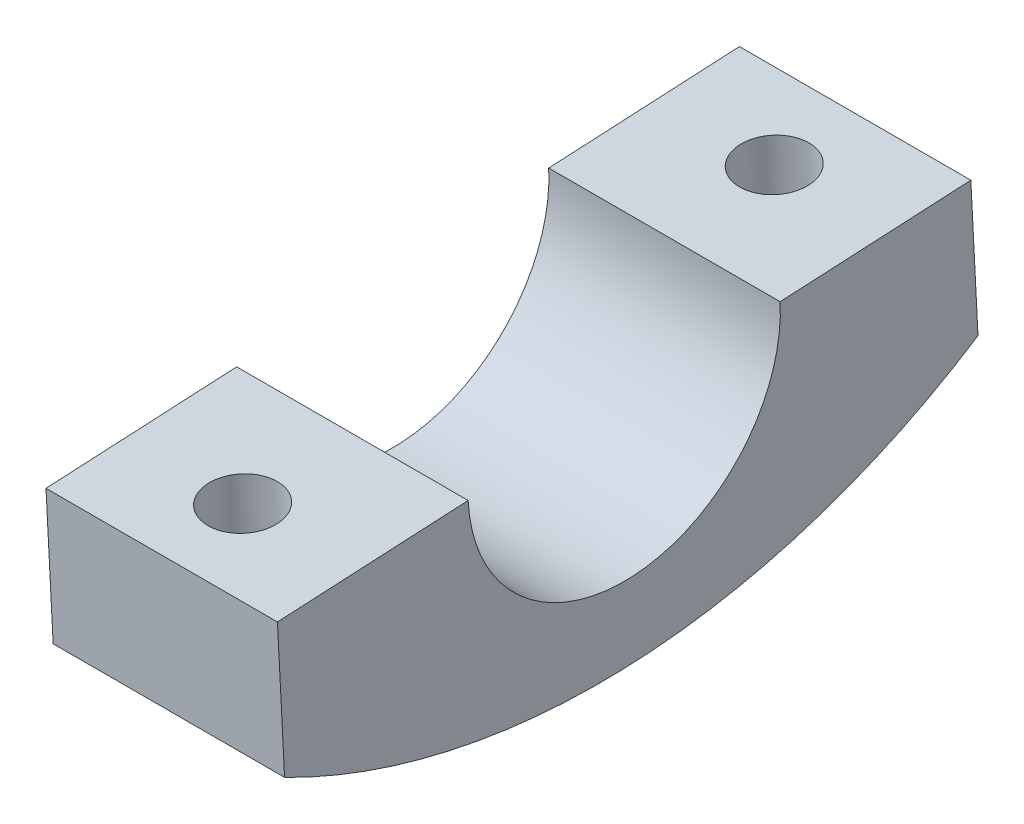
ISO-10303-21;
HEADER;
FILE_DESCRIPTION(('STEP AP214'),'2;1');
FILE_NAME('part.step','',(''),(''),'','','');
FILE_SCHEMA(('AUTOMOTIVE_DESIGN { 1 0 10303 214 1 1 1 1 }'));
ENDSEC;
DATA;
#1=APPLICATION_CONTEXT('core data for automotive mechanical design processes');
#2=APPLICATION_PROTOCOL_DEFINITION('international standard','automotive_design',2000,#1);
#3=PRODUCT_CONTEXT('',#1,'mechanical');
#4=PRODUCT('Part','Part','',(#3));
#5=PRODUCT_RELATED_PRODUCT_CATEGORY('part','',(#4));
#6=PRODUCT_DEFINITION_FORMATION('','',#4);
#7=PRODUCT_DEFINITION_CONTEXT('part definition',#1,'design');
#8=PRODUCT_DEFINITION('design','',#6,#7);
#9=PRODUCT_DEFINITION_SHAPE('','',#8);
#10=(LENGTH_UNIT() NAMED_UNIT(*) SI_UNIT(.MILLI.,.METRE.));
#11=(NAMED_UNIT(*) PLANE_ANGLE_UNIT() SI_UNIT($,.RADIAN.));
#12=(NAMED_UNIT(*) SI_UNIT($,.STERADIAN.) SOLID_ANGLE_UNIT());
#13=UNCERTAINTY_MEASURE_WITH_UNIT(LENGTH_MEASURE(1.E-05),#10,'distance_accuracy_value','');
#14=(GEOMETRIC_REPRESENTATION_CONTEXT(3) GLOBAL_UNCERTAINTY_ASSIGNED_CONTEXT((#13)) GLOBAL_UNIT_ASSIGNED_CONTEXT((#10,
#11,#12)) REPRESENTATION_CONTEXT('',''));
#15=CARTESIAN_POINT('',(0.,0.,0.));
#16=DIRECTION('',(0.,0.,1.));
#17=DIRECTION('',(1.,0.,0.));
#18=AXIS2_PLACEMENT_3D('',#15,#16,#17);
#19=CARTESIAN_POINT('',(20.,219.261332748783,3990.61911649571));
#20=DIRECTION('',(-1.,0.,0.));
#21=DIRECTION('',(0.,0.,1.));
#22=AXIS2_PLACEMENT_3D('',#19,#20,#21);
#23=CYLINDRICAL_SURFACE('',#22,59.9999999999999);
#24=CARTESIAN_POINT('',(12.6925824035531,168.918830501828,3957.97508997453));
#25=CARTESIAN_POINT('',(12.8918575892867,168.870693933646,3958.04932884496));
#26=CARTESIAN_POINT('',(13.0869006497999,168.8176326054,3958.13151306236));
#27=CARTESIAN_POINT('',(13.4672297740175,168.702748389836,3958.31058944848));
#28=CARTESIAN_POINT('',(13.652523448015,168.640932479727,3958.40746990894));
#29=CARTESIAN_POINT('',(14.011526599575,168.509859226538,3958.61438507205));
#30=CARTESIAN_POINT('',(14.1852868816071,168.440638592483,3958.72435516315));
#31=CARTESIAN_POINT('',(14.5213657738825,168.295539397078,3958.95673062363));
#32=CARTESIAN_POINT('',(14.6836821731344,168.219659555473,3959.07913838491));
#33=CARTESIAN_POINT('',(14.9956373292621,168.062508283365,3959.33489036263));
#34=CARTESIAN_POINT('',(15.1453158910343,167.981255337644,3959.46819742243));
#35=CARTESIAN_POINT('',(15.4320589213895,167.814069317554,3959.74509346105));
#36=CARTESIAN_POINT('',(15.5691188587406,167.728134579492,3959.88868610066));
#37=CARTESIAN_POINT('',(15.9608530995083,167.464503534855,3960.33368923386));
#38=CARTESIAN_POINT('',(16.195941430184,167.281052275497,3960.64920886163));
#39=CARTESIAN_POINT('',(16.6303450674783,166.88738765179,3961.34210970982));
#40=CARTESIAN_POINT('',(16.8240415403241,166.676297707441,3961.72252208433));
#41=CARTESIAN_POINT('',(17.0616753380039,166.357595925663,3962.31284320151));
#42=CARTESIAN_POINT('',(17.1320917652659,166.250959528602,3962.51301379589));
#43=CARTESIAN_POINT('',(17.2548960072896,166.037777722091,3962.91883524779));
#44=CARTESIAN_POINT('',(17.3072895388382,165.931232294502,3963.12448434521));
#45=CARTESIAN_POINT('',(17.3962038825714,165.712747006982,3963.55234626329));
#46=CARTESIAN_POINT('',(17.4316032175293,165.600860609197,3963.77481956673));
#47=CARTESIAN_POINT('',(17.4812843844083,165.37900349324,3964.22296011985));
#48=CARTESIAN_POINT('',(17.4955740153601,165.269032082418,3964.44862615886));
#49=CARTESIAN_POINT('',(17.5026709930364,165.051756612034,3964.90170982088));
#50=CARTESIAN_POINT('',(17.4954686170726,164.944453781841,3965.12912819021));
#51=CARTESIAN_POINT('',(17.459260690759,164.733411445397,3965.58377002616));
#52=CARTESIAN_POINT('',(17.430265095486,164.629670334783,3965.81099353435));
#53=CARTESIAN_POINT('',(17.3512080761771,164.428771649236,3966.25830818574));
#54=CARTESIAN_POINT('',(17.301643015946,164.331517816753,3966.47844368379));
#55=CARTESIAN_POINT('',(17.1815180832235,164.14176561256,3966.91489923137));
#56=CARTESIAN_POINT('',(17.1109673734945,164.049265186045,3967.13122090253));
#57=CARTESIAN_POINT('',(16.9490152839946,163.869576947403,3967.55817475308));
#58=CARTESIAN_POINT('',(16.8576160093719,163.782388600024,3967.7688075045));
#59=CARTESIAN_POINT('',(16.6543161422313,163.613848423299,3968.18237552162));
#60=CARTESIAN_POINT('',(16.5424169355575,163.532496199934,3968.38531130653));
#61=CARTESIAN_POINT('',(16.306801865344,163.381282336956,3968.76826961665));
#62=CARTESIAN_POINT('',(16.1843630546434,163.311016425395,3968.94891898739));
#63=CARTESIAN_POINT('',(15.9228131484103,163.176293385962,3969.3000237532));
#64=CARTESIAN_POINT('',(15.7837032011436,163.111835858559,3969.47047984916));
#65=CARTESIAN_POINT('',(15.4897249967572,162.989007253703,3969.79950500223));
#66=CARTESIAN_POINT('',(15.3348610324396,162.930634526936,3969.9580772772));
#67=CARTESIAN_POINT('',(15.0104213501098,162.820164986589,3970.26179101645));
#68=CARTESIAN_POINT('',(14.8408462947235,162.76806789059,3970.40693308504));
#69=CARTESIAN_POINT('',(14.4990245640607,162.673290679058,3970.67388338625));
#70=CARTESIAN_POINT('',(14.3275724725477,162.630229899009,3970.79657505991));
#71=CARTESIAN_POINT('',(13.9740173315233,162.549871008494,3971.02766229346));
#72=CARTESIAN_POINT('',(13.7919147941147,162.512572621269,3971.13605853989));
#73=CARTESIAN_POINT('',(13.4184072504306,162.44380540272,3971.3375210949));
#74=CARTESIAN_POINT('',(13.22700379828,162.412335601676,3971.43058995325));
#75=CARTESIAN_POINT('',(12.8362959776022,162.35525578939,3971.60053486409));
#76=CARTESIAN_POINT('',(12.6369917474128,162.329645675601,3971.67741119995));
#77=CARTESIAN_POINT('',(12.2392803518228,162.285119413633,3971.811779007));
#78=CARTESIAN_POINT('',(12.0410977362077,162.265995998797,3971.8698672012));
#79=CARTESIAN_POINT('',(11.6402361332911,162.233221785474,3971.96979133098));
#80=CARTESIAN_POINT('',(11.4375572690062,162.219570837454,3972.01162771062));
#81=CARTESIAN_POINT('',(11.0291943387053,162.197744100676,3972.07867163647));
#82=CARTESIAN_POINT('',(10.8235105241181,162.189567856491,3972.10388056586));
#83=CARTESIAN_POINT('',(10.4106281276833,162.178688424372,3972.13744909046));
#84=CARTESIAN_POINT('',(10.2034295514045,162.175985216327,3972.14580874758));
#85=CARTESIAN_POINT('',(9.79212921496034,162.176050950103,3972.14560573137));
#86=CARTESIAN_POINT('',(9.58802726905062,162.178739033027,3972.13729310982));
#87=CARTESIAN_POINT('',(9.18121851573012,162.189428191364,3972.10431133245));
#88=CARTESIAN_POINT('',(8.97851220875276,162.19743108151,3972.07963658981));
#89=CARTESIAN_POINT('',(8.57605457189065,162.218749515713,3972.01414723362));
#90=CARTESIAN_POINT('',(8.37630259337743,162.232063875116,3971.97333621906));
#91=CARTESIAN_POINT('',(7.98111554751912,162.264003734349,3971.87592815759));
#92=CARTESIAN_POINT('',(7.78568057104067,162.282629345859,3971.81933077874));
#93=CARTESIAN_POINT('',(7.40060690080018,162.325172724418,3971.69087694832));
#94=CARTESIAN_POINT('',(7.21096506130666,162.349087559063,3971.61902895275));
#95=CARTESIAN_POINT('',(6.83866811400861,162.402199408377,3971.46067383432));
#96=CARTESIAN_POINT('',(6.65601313794026,162.431396522584,3971.37416643523));
#97=CARTESIAN_POINT('',(6.29895956636046,162.495036500121,3971.18725221226));
#98=CARTESIAN_POINT('',(6.12455947373713,162.529478407435,3971.08684792178));
#99=CARTESIAN_POINT('',(5.78506679510095,162.603575339016,3970.87294382088));
#100=CARTESIAN_POINT('',(5.61997748320467,162.643232180972,3970.75943944607));
#101=CARTESIAN_POINT('',(5.29822628962452,162.728202965281,3970.51882517304));
#102=CARTESIAN_POINT('',(5.14169492133268,162.773581192604,3970.39156347726));
#103=CARTESIAN_POINT('',(4.84022948545276,162.869509326859,3970.12564849597));
#104=CARTESIAN_POINT('',(4.69529967479175,162.920061116751,3969.98699106653));
#105=CARTESIAN_POINT('',(4.41796595495633,163.026176785746,3969.69949165973));
#106=CARTESIAN_POINT('',(4.28556026630324,163.081739950615,3969.55065113442));
#107=CARTESIAN_POINT('',(4.03396016481127,163.197712712304,3969.24395839529));
#108=CARTESIAN_POINT('',(3.91476648903119,163.258122579185,3969.08610567946));
#109=CARTESIAN_POINT('',(3.68670559863705,163.385516341266,3968.75761797722));
#110=CARTESIAN_POINT('',(3.57827153166037,163.45264573455,3968.58673869481));
#111=CARTESIAN_POINT('',(3.376559660398,163.591558098273,3968.23806631742));
#112=CARTESIAN_POINT('',(3.28328246110761,163.663341254309,3968.06027294681));
#113=CARTESIAN_POINT('',(3.11223888301205,163.811244846049,3967.69912912037));
#114=CARTESIAN_POINT('',(3.0344721468693,163.887365181779,3967.51577879268));
#115=CARTESIAN_POINT('',(2.89464003375428,164.043619657252,3967.14477532647));
#116=CARTESIAN_POINT('',(2.83258022932898,164.123755209479,3966.95712068654));
#117=CARTESIAN_POINT('',(2.72145087843736,164.29193925348,3966.56890165213));
#118=CARTESIAN_POINT('',(2.67323506071429,164.380182283189,3966.36817695844));
#119=CARTESIAN_POINT('',(2.59432808868308,164.560204060446,3965.9647997158));
#120=CARTESIAN_POINT('',(2.56364352204922,164.651984123285,3965.76214647121));
#121=CARTESIAN_POINT('',(2.51972012646667,164.838526322891,3965.35633826807));
#122=CARTESIAN_POINT('',(2.50647969096449,164.933288184219,3965.15318335744));
#123=CARTESIAN_POINT('',(2.49723524814939,165.125249435114,3964.74760751109));
#124=CARTESIAN_POINT('',(2.50123742502912,165.222449686798,3964.54518686478));
#125=CARTESIAN_POINT('',(2.54042962309447,165.529755188305,3963.91434753183));
#126=CARTESIAN_POINT('',(2.60576010164722,165.743286730545,3963.48911163753));
#127=CARTESIAN_POINT('',(2.81084263777274,166.172687352789,3962.65816614472));
#128=CARTESIAN_POINT('',(2.95061407827022,166.388557027248,3962.25246166182));
#129=CARTESIAN_POINT('',(3.21745010771056,166.71384926745,3961.65678118965));
#130=CARTESIAN_POINT('',(3.31892937155765,166.825058623929,3961.45599167551));
#131=CARTESIAN_POINT('',(3.54080991132869,167.045098642271,3961.06382409455));
#132=CARTESIAN_POINT('',(3.66120409353774,167.153930178536,3960.87244253462));
#133=CARTESIAN_POINT('',(3.92055057982027,167.368200958184,3960.50020056697));
#134=CARTESIAN_POINT('',(4.05952790084516,167.473635386636,3960.31935482235));
#135=CARTESIAN_POINT('',(4.35524374923841,167.67964015668,3959.96997152995));
#136=CARTESIAN_POINT('',(4.51197359222992,167.78021284253,3959.8014280298));
#137=CARTESIAN_POINT('',(4.83927561865108,167.973245545321,3959.48125570749));
#138=CARTESIAN_POINT('',(5.00951403467004,168.065826401986,3959.32935894896));
#139=CARTESIAN_POINT('',(5.36565969788903,168.243671873931,3959.04021375354));
#140=CARTESIAN_POINT('',(5.55157051412906,168.328934813749,3958.90296866947));
#141=CARTESIAN_POINT('',(5.93728218903124,168.490354896823,3958.64520737646));
#142=CARTESIAN_POINT('',(6.13703145505451,168.566543257622,3958.52463357174));
#143=CARTESIAN_POINT('',(6.54956991947036,168.708614653927,3958.30131637036));
#144=CARTESIAN_POINT('',(6.76234595906862,168.774507857455,3958.19855536975));
#145=CARTESIAN_POINT('',(7.03452723470459,168.84929752171,3958.08256095836));
#146=CARTESIAN_POINT('',(7.08866394712375,168.863722470343,3958.06022295745));
#147=CARTESIAN_POINT('',(7.19756546695407,168.891832443374,3958.01675295132));
#148=CARTESIAN_POINT('',(7.2523298345465,168.905517951584,3957.99562015702));
#149=CARTESIAN_POINT('',(7.3074175964468,168.918830501828,3957.97508997453));
#150=B_SPLINE_CURVE_WITH_KNOTS('',3,(#24,#25,#26,#27,#28,#29,#30,#31,#32,#33,#34,#35,#36,#37,
#38,#39,#40,#41,#42,#43,#44,#45,#46,#47,#48,#49,#50,#51,#52,#53,#54,#55,#56,#57,#58,#59,#60,#61,
#62,#63,#64,#65,#66,#67,#68,#69,#70,#71,#72,#73,#74,#75,#76,#77,#78,#79,#80,#81,#82,#83,#84,#85,
#86,#87,#88,#89,#90,#91,#92,#93,#94,#95,#96,#97,#98,#99,#100,#101,#102,#103,#104,#105,#106,#107,
#108,#109,#110,#111,#112,#113,#114,#115,#116,#117,#118,#119,#120,#121,#122,#123,#124,#125,#126,
#127,#128,#129,#130,#131,#132,#133,#134,#135,#136,#137,#138,#139,#140,#141,#142,#143,#144,#145,
#146,#147,#148,#149),.UNSPECIFIED.,.F.,.F.,(4,2,2,2,2,2,2,2,2,2,2,2,2,2,2,2,2,2,2,2,2,2,2,2,2,2,
2,2,2,2,2,2,2,2,2,2,2,2,2,2,2,2,2,2,2,2,2,2,2,2,2,2,2,2,2,2,2,2,2,2,2,2,4),(0.,
0.653755744365878,1.30699336162574,1.95713074483776,2.60739339421188,3.2555249462002,
3.90388833583695,5.20119630716475,6.62333505999947,7.33517164203455,8.04678222384112,
8.80046185364646,9.55386296501464,10.3076049563536,11.0610028497287,11.797189963166,
12.5330561129446,13.2688479927653,14.0045901496512,14.691504743799,15.3783720521675,
16.0650526953094,16.7517024246015,17.3964481180394,18.0411628357729,18.6857701936612,
19.3303662698507,19.9518266758719,20.5732700997689,21.1946618210278,21.8160512590054,
22.4281907530646,23.0405393688695,23.6527514845977,24.2649764742486,24.8768628867024,
25.4887608304933,26.1005473714354,26.7125477213919,27.3321676040689,27.9520138098127,
28.5717718125516,29.1915643723588,29.8305173728566,30.4694958712782,31.1084596469015,
31.7476497990153,32.4204199715272,33.0934427832117,33.7664036071281,34.4396058135959,
35.8737871717582,37.3083421445121,38.0604670716909,38.812310597734,39.5651766551701,
40.3176759949746,41.0553417751285,41.7931759983903,42.528393818596,43.2628808464005,
43.4438124039154,43.6246241085267),.UNSPECIFIED.);
#151=CARTESIAN_POINT('',(12.6925824035531,168.918830501835,3957.97508997453));
#152=VERTEX_POINT('',#151);
#153=CARTESIAN_POINT('',(7.30741759644689,168.918830501828,3957.97508997453));
#154=VERTEX_POINT('',#153);
#155=EDGE_CURVE('E127',#152,#154,#150,.T.);
#156=ORIENTED_EDGE('',*,*,#155,.F.);
#157=DIRECTION('',(-1.,0.,0.));
#158=VECTOR('',#157,1.);
#159=CARTESIAN_POINT('',(20.,168.918830501828,3957.97508997453));
#160=LINE('',#159,#158);
#161=CARTESIAN_POINT('',(20.,168.918830501828,3957.97508997453));
#162=VERTEX_POINT('',#161);
#163=EDGE_CURVE('E12',#162,#152,#160,.T.);
#164=ORIENTED_EDGE('',*,*,#163,.F.);
#165=CARTESIAN_POINT('',(20.,219.261332748783,3990.61911649571));
#166=DIRECTION('',(1.,0.,0.));
#167=DIRECTION('',(0.,0.,-1.));
#168=AXIS2_PLACEMENT_3D('',#165,#166,#167);
#169=CIRCLE('',#168,59.9999999999999);
#170=CARTESIAN_POINT('',(20.,165.819525376152,4017.89498907106));
#171=VERTEX_POINT('',#170);
#172=EDGE_CURVE('E154',#171,#162,#169,.T.);
#173=ORIENTED_EDGE('',*,*,#172,.F.);
#174=DIRECTION('',(-1.,0.,0.));
#175=VECTOR('',#174,1.);
#176=CARTESIAN_POINT('',(20.,165.819525376152,4017.89498907106));
#177=LINE('',#176,#175);
#178=CARTESIAN_POINT('',(12.692582403567,165.819525376152,4017.89498907106));
#179=VERTEX_POINT('',#178);
#180=EDGE_CURVE('E189',#171,#179,#177,.T.);
#181=ORIENTED_EDGE('',*,*,#180,.T.);
#182=CARTESIAN_POINT('',(12.692582403567,165.819525376152,4017.89498907106));
#183=CARTESIAN_POINT('',(12.8918575893004,165.779305079874,4017.81618001798));
#184=CARTESIAN_POINT('',(13.0869006498136,165.73500604382,4017.72895991967));
#185=CARTESIAN_POINT('',(13.467229774031,165.639210621095,4017.53898631089));
#186=CARTESIAN_POINT('',(13.6525234480284,165.587719966433,4017.43624516604));
#187=CARTESIAN_POINT('',(14.0115265995882,165.478694088078,4017.21691108233));
#188=CARTESIAN_POINT('',(14.18528688162,165.421188711396,4017.10038619757));
#189=CARTESIAN_POINT('',(14.5213657738951,165.300838536378,4016.85428059724));
#190=CARTESIAN_POINT('',(14.6836821731469,165.237992711396,4016.72469737045));
#191=CARTESIAN_POINT('',(14.9956373292741,165.108066583416,4016.45409656169));
#192=CARTESIAN_POINT('',(15.1453158910459,165.04100083302,4016.31311784519));
#193=CARTESIAN_POINT('',(15.4320589214005,164.903274987789,4016.0204505032));
#194=CARTESIAN_POINT('',(15.5691188587512,164.832613615832,4015.86875806479));
#195=CARTESIAN_POINT('',(15.9608530995182,164.616301411739,4015.39893028079));
#196=CARTESIAN_POINT('',(16.1959414301937,164.466382009224,4015.06616734292));
#197=CARTESIAN_POINT('',(16.6303450674868,164.146306314777,4014.33634889207));
#198=CARTESIAN_POINT('',(16.8240415403316,163.975590851699,4013.936187962));
#199=CARTESIAN_POINT('',(17.0616753380102,163.719494578622,4013.31613591095));
#200=CARTESIAN_POINT('',(17.132091765272,163.634079296885,4013.10603160905));
#201=CARTESIAN_POINT('',(17.2548960072948,163.463904646548,4012.6803813749));
#202=CARTESIAN_POINT('',(17.3072895388427,163.379145078314,4012.46483719148));
#203=CARTESIAN_POINT('',(17.3962038825746,163.205969213464,4012.01671693793));
#204=CARTESIAN_POINT('',(17.431603217532,163.11763296829,4011.7838872909));
#205=CARTESIAN_POINT('',(17.4812843844099,162.94319546116,4011.31524874002));
#206=CARTESIAN_POINT('',(17.495574015361,162.857093385342,4011.07944096895));
#207=CARTESIAN_POINT('',(17.5026709930361,162.687723065521,4010.60635838675));
#208=CARTESIAN_POINT('',(17.4954686170716,162.604456121326,4010.36908296012));
#209=CARTESIAN_POINT('',(17.4592606907568,162.441446432664,4009.89509360563));
#210=CARTESIAN_POINT('',(17.4302650954832,162.361702096684,4009.65837947089));
#211=CARTESIAN_POINT('',(17.3512080761731,162.208025965251,4009.19272474276));
#212=CARTESIAN_POINT('',(17.3016430159413,162.134003002114,4008.96373010011));
#213=CARTESIAN_POINT('',(17.1815180832176,161.990293510709,4008.51002653379));
#214=CARTESIAN_POINT('',(17.110967373488,161.920605105907,4008.28531578515));
#215=CARTESIAN_POINT('',(16.9490152839869,161.785925562281,4007.84210153207));
#216=CARTESIAN_POINT('',(16.8576160093637,161.720933950078,4007.62359740343));
#217=CARTESIAN_POINT('',(16.6543161422219,161.595961930228,4007.19484772097));
#218=CARTESIAN_POINT('',(16.5424169355474,161.535981184233,4006.98460161006));
#219=CARTESIAN_POINT('',(16.3068018653331,161.425084943982,4006.58808588081));
#220=CARTESIAN_POINT('',(16.1843630546325,161.373832008236,4006.40115105245));
#221=CARTESIAN_POINT('',(15.9228131483986,161.276052186477,4006.03802027658));
#222=CARTESIAN_POINT('',(15.783703201131,161.229524975376,4005.8618235907));
#223=CARTESIAN_POINT('',(15.4897249967437,161.141298110263,4005.52188177539));
#224=CARTESIAN_POINT('',(15.334861032426,161.099597147735,4005.35813327511));
#225=CARTESIAN_POINT('',(15.0104213500956,161.021051957516,4005.04464291187));
#226=CARTESIAN_POINT('',(14.8408462947087,160.984207511264,4004.89490041868));
#227=CARTESIAN_POINT('',(14.4990245640453,160.917477941188,4004.61959631842));
#228=CARTESIAN_POINT('',(14.3275724725322,160.887305330862,4004.49311671077));
#229=CARTESIAN_POINT('',(13.9740173315073,160.831217065103,4004.2549718657));
#230=CARTESIAN_POINT('',(13.7919147940984,160.805301205222,4004.14330591683));
#231=CARTESIAN_POINT('',(13.4184072504137,160.757686307775,4003.9358235972));
#232=CARTESIAN_POINT('',(13.2270037982628,160.73598656873,4003.84000459023));
#233=CARTESIAN_POINT('',(12.8362959775846,160.696744961483,4003.665077537));
#234=CARTESIAN_POINT('',(12.636991747395,160.679203020517,4003.5859691983));
#235=CARTESIAN_POINT('',(12.2392803518043,160.648777401764,4003.44772456984));
#236=CARTESIAN_POINT('',(12.0410977361889,160.635749128657,4003.3879733573));
#237=CARTESIAN_POINT('',(11.6402361332721,160.613459212103,4003.28520108287));
#238=CARTESIAN_POINT('',(11.4375572689874,160.604197465738,4003.24217956386));
#239=CARTESIAN_POINT('',(11.0291943386866,160.58940427994,4003.17324150409));
#240=CARTESIAN_POINT('',(10.8235105240993,160.583872530218,4003.14732354053));
#241=CARTESIAN_POINT('',(10.4106281276645,160.576514496362,4003.11281169873));
#242=CARTESIAN_POINT('',(10.2034295513857,160.574688198612,4003.10421775682));
#243=CARTESIAN_POINT('',(9.7921292149416,160.574732635961,4003.10442647154));
#244=CARTESIAN_POINT('',(9.58802726903196,160.576548742071,4003.11297206839));
#245=CARTESIAN_POINT('',(9.18121851571168,160.583778053573,4003.14688066316));
#246=CARTESIAN_POINT('',(8.97851220873445,160.589192487609,4003.17224940533));
#247=CARTESIAN_POINT('',(8.57605457187257,160.603640471835,4003.23958874868));
#248=CARTESIAN_POINT('',(8.37630259335945,160.612673215011,4003.28155564786));
#249=CARTESIAN_POINT('',(7.98111554750149,160.634392818431,4003.38173919878));
#250=CARTESIAN_POINT('',(7.78568057102329,160.647079755513,4003.43995619221));
#251=CARTESIAN_POINT('',(7.40060690078314,160.676143230781,4003.57211382541));
#252=CARTESIAN_POINT('',(7.21096506128969,160.692517724637,4003.64604575177));
#253=CARTESIAN_POINT('',(6.83866811399199,160.729008288894,4003.8090354778));
#254=CARTESIAN_POINT('',(6.6560131379239,160.749124429801,4003.8980935625));
#255=CARTESIAN_POINT('',(6.29895956634458,160.793140431888,4004.09057619822));
#256=CARTESIAN_POINT('',(6.12455947372146,160.817039603532,4004.19399813071));
#257=CARTESIAN_POINT('',(5.7850667950859,160.868672149736,4004.41440548045));
#258=CARTESIAN_POINT('',(5.61997748319003,160.896406861365,4004.53139562528));
#259=CARTESIAN_POINT('',(5.29822628961076,160.956099483465,4004.7794924883));
#260=CARTESIAN_POINT('',(5.14169492131936,160.988105674552,4004.91075682641));
#261=CARTESIAN_POINT('',(4.8402294854403,161.056086841744,4005.18514987502));
#262=CARTESIAN_POINT('',(4.69529967477969,161.092063263221,4005.3282829016));
#263=CARTESIAN_POINT('',(4.41796595494522,161.167950685668,4005.6251962614));
#264=CARTESIAN_POINT('',(4.28556026629266,161.207861126026,4005.77897507664));
#265=CARTESIAN_POINT('',(4.03396016480118,161.291572819549,4006.09599632207));
#266=CARTESIAN_POINT('',(3.91476648902111,161.335374289539,4006.25923927946));
#267=CARTESIAN_POINT('',(3.68670559862757,161.428197399947,4006.59911750959));
#268=CARTESIAN_POINT('',(3.5782715316514,161.47733855743,4006.77601078601));
#269=CARTESIAN_POINT('',(3.37655966038991,161.579536302154,4007.13715437591));
#270=CARTESIAN_POINT('',(3.2832824610999,161.632593045566,4007.3214049827));
#271=CARTESIAN_POINT('',(3.11223888300528,161.742447329197,4007.69588111303));
#272=CARTESIAN_POINT('',(3.03447214686308,161.799244783197,4007.88610649881));
#273=CARTESIAN_POINT('',(2.8946400337489,161.916388144885,4008.27125123246));
#274=CARTESIAN_POINT('',(2.83258022932387,161.976735302615,4008.46617221946));
#275=CARTESIAN_POINT('',(2.72145087843297,162.10396840183,4008.86967145093));
#276=CARTESIAN_POINT('',(2.67323506071039,162.171031304667,4009.0784292101));
#277=CARTESIAN_POINT('',(2.59432808868019,162.308475058672,4009.49822708367));
#278=CARTESIAN_POINT('',(2.56364352204681,162.378857146342,4009.70926802569));
#279=CARTESIAN_POINT('',(2.51972012646527,162.522535718825,4010.1321566136));
#280=CARTESIAN_POINT('',(2.50647969096359,162.595831934614,4010.3440041834));
#281=CARTESIAN_POINT('',(2.49723524814948,162.744924612416,4010.76722075019));
#282=CARTESIAN_POINT('',(2.50123742502974,162.820721961804,4010.97858954828));
#283=CARTESIAN_POINT('',(2.54042962309675,163.061302415314,4011.63776780994));
#284=CARTESIAN_POINT('',(2.60576010165054,163.229821903306,4012.08276496443));
#285=CARTESIAN_POINT('',(2.81084263777821,163.571200514672,4012.95357834863));
#286=CARTESIAN_POINT('',(2.95061407827684,163.744060757115,4013.37938955136));
#287=CARTESIAN_POINT('',(3.21745010771894,164.006159381949,4014.00545230966));
#288=CARTESIAN_POINT('',(3.31892937156658,164.09605936418,4014.21664403097));
#289=CARTESIAN_POINT('',(3.54080991133869,164.274464328118,4014.62942083516));
#290=CARTESIAN_POINT('',(3.66120409354825,164.362969819168,4014.8310094827));
#291=CARTESIAN_POINT('',(3.9205505798319,164.537692102292,4015.22337178119));
#292=CARTESIAN_POINT('',(4.05952790085741,164.623905617954,4015.4141303505));
#293=CARTESIAN_POINT('',(4.35524374925188,164.792764383961,4015.78290313615));
#294=CARTESIAN_POINT('',(4.51197359224398,164.875411351935,4015.96092351494));
#295=CARTESIAN_POINT('',(4.83927561866615,165.034381037586,4016.29930285734));
#296=CARTESIAN_POINT('',(5.0095140346855,165.110796306527,4016.45994079479));
#297=CARTESIAN_POINT('',(5.36565969790531,165.257860946424,4016.76589168564));
#298=CARTESIAN_POINT('',(5.5515705141458,165.328508996775,4016.91120113127));
#299=CARTESIAN_POINT('',(5.93728218904876,165.462473849648,4017.18424095546));
#300=CARTESIAN_POINT('',(6.13703145507234,165.525815760836,4017.31203184321));
#301=CARTESIAN_POINT('',(6.54956991948882,165.644088855566,4017.54881513894));
#302=CARTESIAN_POINT('',(6.7623459590874,165.699028336629,4017.657826106));
#303=CARTESIAN_POINT('',(7.03452723471839,165.761451481724,4017.78091773166));
#304=CARTESIAN_POINT('',(7.08866394713215,165.77349478986,4017.80462478033));
#305=CARTESIAN_POINT('',(7.1975654669516,165.796969855789,4017.85076297813));
#306=CARTESIAN_POINT('',(7.25232983453855,165.8084020134,4017.87319496204));
#307=CARTESIAN_POINT('',(7.30741759643325,165.819525376152,4017.89498907106));
#308=B_SPLINE_CURVE_WITH_KNOTS('',3,(#182,#183,#184,#185,#186,#187,#188,#189,#190,#191,#192,
#193,#194,#195,#196,#197,#198,#199,#200,#201,#202,#203,#204,#205,#206,#207,#208,#209,#210,#211,
#212,#213,#214,#215,#216,#217,#218,#219,#220,#221,#222,#223,#224,#225,#226,#227,#228,#229,#230,
#231,#232,#233,#234,#235,#236,#237,#238,#239,#240,#241,#242,#243,#244,#245,#246,#247,#248,#249,
#250,#251,#252,#253,#254,#255,#256,#257,#258,#259,#260,#261,#262,#263,#264,#265,#266,#267,#268,
#269,#270,#271,#272,#273,#274,#275,#276,#277,#278,#279,#280,#281,#282,#283,#284,#285,#286,#287,
#288,#289,#290,#291,#292,#293,#294,#295,#296,#297,#298,#299,#300,#301,#302,#303,#304,#305,#306,
#307),.UNSPECIFIED.,.F.,.F.,(4,2,2,2,2,2,2,2,2,2,2,2,2,2,2,2,2,2,2,2,2,2,2,2,2,2,2,2,2,2,2,2,2,
2,2,2,2,2,2,2,2,2,2,2,2,2,2,2,2,2,2,2,2,2,2,2,2,2,2,2,2,2,4),(0.,0.653755744366443,
1.30699336162673,1.95713074483952,2.60739339421429,3.25552494620244,3.90388833584002,
5.20119630716893,6.62333506000528,7.33517164204282,8.04678222384833,8.80046185365356,
9.5538629650229,10.3076049563616,11.0610028497363,11.7971899631737,12.533056112953,
13.2688479927725,14.0045901496585,14.6915047438052,15.3783720521742,16.065052695315,
16.7517024246072,17.396448118045,18.0411628357782,18.6857701936671,19.3303662698565,
19.9518266758779,20.5732700997743,21.1946618210332,21.8160512590107,22.4281907530697,
23.0405393688744,23.6527514846027,24.2649764742535,24.8768628867072,25.4887608304984,
26.1005473714402,26.7125477213969,27.3321676040731,27.9520138098165,28.5717718125548,
29.1915643723639,29.8305173728612,30.469495871283,31.1084596469064,31.7476497990202,
32.4204199715334,33.0934427832182,33.7664036071347,34.4396058136041,35.8737871717663,
37.308342144521,38.0604670716996,38.8123105977427,39.5651766551799,40.317675994985,
41.0553417751383,41.7931759984004,42.5283938186056,43.26288084641,43.4438124039066,
43.6246241085001),.UNSPECIFIED.);
#309=CARTESIAN_POINT('',(7.30741759643301,165.819525376152,4017.89498907106));
#310=VERTEX_POINT('',#309);
#311=EDGE_CURVE('E210',#179,#310,#308,.T.);
#312=ORIENTED_EDGE('',*,*,#311,.T.);
#313=CARTESIAN_POINT('',(0.,165.819525376152,4017.89498907106));
#314=VERTEX_POINT('',#313);
#315=EDGE_CURVE('E178',#310,#314,#177,.T.);
#316=ORIENTED_EDGE('',*,*,#315,.T.);
#317=CARTESIAN_POINT('',(0.,219.261332748783,3990.61911649571));
#318=DIRECTION('',(1.,0.,0.));
#319=DIRECTION('',(0.,0.,-1.));
#320=AXIS2_PLACEMENT_3D('',#317,#318,#319);
#321=CIRCLE('',#320,59.9999999999999);
#322=CARTESIAN_POINT('',(0.,168.918830501828,3957.97508997453));
#323=VERTEX_POINT('',#322);
#324=EDGE_CURVE('E179',#314,#323,#321,.T.);
#325=ORIENTED_EDGE('',*,*,#324,.T.);
#326=EDGE_CURVE('E68',#154,#323,#160,.T.);
#327=ORIENTED_EDGE('',*,*,#326,.F.);
#328=EDGE_LOOP('',(#156,#164,#173,#181,#312,#316,#325,#327));
#329=FACE_BOUND('',#328,.T.);
#330=ADVANCED_FACE('F59',(#329),#23,.T.);
#331=CARTESIAN_POINT('',(20.,177.765080788257,4018.51286262686));
#332=DIRECTION('',(0.,-0.998664984942108,-0.0516550854280407));
#333=DIRECTION('',(0.,0.0516550854280407,-0.998664984942109));
#334=AXIS2_PLACEMENT_3D('',#331,#332,#333);
#335=PLANE('',#334);
#336=CARTESIAN_POINT('',(10.,178.126666386254,4011.52220773226));
#337=DIRECTION('',(0.,0.998664984942109,0.0516550854280407));
#338=DIRECTION('',(0.,-0.0516550854280407,0.998664984942109));
#339=AXIS2_PLACEMENT_3D('',#336,#337,#338);
#340=CIRCLE('',#339,2.99999999999986);
#341=CARTESIAN_POINT('',(10.,177.97170112997,4014.51820268709));
#342=VERTEX_POINT('',#341);
#343=EDGE_CURVE('E237',#342,#342,#340,.T.);
#344=ORIENTED_EDGE('',*,*,#343,.F.);
#345=EDGE_LOOP('',(#344));
#346=FACE_BOUND('',#345,.T.);
#347=DIRECTION('',(0.,-0.0516550854280407,0.998664984942108));
#348=VECTOR('',#347,1.);
#349=CARTESIAN_POINT('',(20.,177.765080788257,4018.51286262686));
#350=LINE('',#349,#348);
#351=CARTESIAN_POINT('',(20.,178.61738969782,4002.03489037531));
#352=VERTEX_POINT('',#351);
#353=CARTESIAN_POINT('',(20.,177.765080788257,4018.51286262686));
#354=VERTEX_POINT('',#353);
#355=EDGE_CURVE('E153',#352,#354,#350,.T.);
#356=ORIENTED_EDGE('',*,*,#355,.F.);
#357=DIRECTION('',(-1.,0.,0.));
#358=VECTOR('',#357,1.);
#359=CARTESIAN_POINT('',(28.,178.61738969782,4002.03489037531));
#360=LINE('',#359,#358);
#361=CARTESIAN_POINT('',(0.,178.61738969782,4002.03489037531));
#362=VERTEX_POINT('',#361);
#363=EDGE_CURVE('E172',#352,#362,#360,.T.);
#364=ORIENTED_EDGE('',*,*,#363,.T.);
#365=DIRECTION('',(0.,-0.0516550854280407,0.998664984942108));
#366=VECTOR('',#365,1.);
#367=CARTESIAN_POINT('',(0.,177.765080788257,4018.51286262686));
#368=LINE('',#367,#366);
#369=CARTESIAN_POINT('',(0.,177.765080788257,4018.51286262686));
#370=VERTEX_POINT('',#369);
#371=EDGE_CURVE('E185',#362,#370,#368,.T.);
#372=ORIENTED_EDGE('',*,*,#371,.T.);
#373=DIRECTION('',(-1.,0.,0.));
#374=VECTOR('',#373,1.);
#375=CARTESIAN_POINT('',(20.,177.765080788257,4018.51286262686));
#376=LINE('',#375,#374);
#377=EDGE_CURVE('E192',#354,#370,#376,.T.);
#378=ORIENTED_EDGE('',*,*,#377,.F.);
#379=EDGE_LOOP('',(#356,#364,#372,#378));
#380=FACE_BOUND('',#379,.T.);
#381=ADVANCED_FACE('F263',(#346,#380),#335,.F.);
#382=CARTESIAN_POINT('',(20.,180.86438591394,3958.59296353033));
#383=DIRECTION('',(0.,-0.0516550854280426,0.998664984942108));
#384=DIRECTION('',(0.,-0.998664984942108,-0.0516550854280426));
#385=AXIS2_PLACEMENT_3D('',#382,#383,#384);
#386=PLANE('',#385);
#387=DIRECTION('',(0.,0.998664984942108,0.0516550854280426));
#388=VECTOR('',#387,1.);
#389=CARTESIAN_POINT('',(0.,180.86438591394,3958.59296353033));
#390=LINE('',#389,#388);
#391=CARTESIAN_POINT('',(0.,180.86438591394,3958.59296353033));
#392=VERTEX_POINT('',#391);
#393=EDGE_CURVE('E182',#323,#392,#390,.T.);
#394=ORIENTED_EDGE('',*,*,#393,.T.);
#395=DIRECTION('',(-1.,0.,0.));
#396=VECTOR('',#395,1.);
#397=CARTESIAN_POINT('',(20.,180.86438591394,3958.59296353033));
#398=LINE('',#397,#396);
#399=CARTESIAN_POINT('',(20.,180.86438591394,3958.59296353033));
#400=VERTEX_POINT('',#399);
#401=EDGE_CURVE('E148',#400,#392,#398,.T.);
#402=ORIENTED_EDGE('',*,*,#401,.F.);
#403=DIRECTION('',(0.,0.998664984942108,0.0516550854280426));
#404=VECTOR('',#403,1.);
#405=CARTESIAN_POINT('',(20.,180.86438591394,3958.59296353033));
#406=LINE('',#405,#404);
#407=EDGE_CURVE('E145',#162,#400,#406,.T.);
#408=ORIENTED_EDGE('',*,*,#407,.F.);
#409=ORIENTED_EDGE('',*,*,#163,.T.);
#410=DIRECTION('',(-1.,0.,0.));
#411=VECTOR('',#410,1.);
#412=CARTESIAN_POINT('',(20.,168.918830501835,3957.97508997453));
#413=LINE('',#412,#411);
#414=EDGE_CURVE('E123',#152,#154,#413,.T.);
#415=ORIENTED_EDGE('',*,*,#414,.T.);
#416=ORIENTED_EDGE('',*,*,#326,.T.);
#417=EDGE_LOOP('',(#394,#402,#408,#409,#415,#416));
#418=FACE_BOUND('',#417,.T.);
#419=ADVANCED_FACE('F143',(#418),#386,.F.);
#420=CARTESIAN_POINT('',(10.,180.502800315943,3965.58361842493));
#421=DIRECTION('',(0.,-0.998664984942109,-0.0516550854280458));
#422=DIRECTION('',(0.,0.0516550854280457,-0.998664984942108));
#423=AXIS2_PLACEMENT_3D('',#420,#421,#422);
#424=CIRCLE('',#423,2.99999999999986);
#425=CARTESIAN_POINT('',(10.,180.657765572227,3962.58762347011));
#426=VERTEX_POINT('',#425);
#427=EDGE_CURVE('E141',#426,#426,#424,.T.);
#428=ORIENTED_EDGE('',*,*,#427,.T.);
#429=EDGE_LOOP('',(#428));
#430=FACE_BOUND('',#429,.T.);
#431=CARTESIAN_POINT('',(0.,180.012077004377,3975.07093578188));
#432=VERTEX_POINT('',#431);
#433=EDGE_CURVE('E169',#392,#432,#368,.T.);
#434=ORIENTED_EDGE('',*,*,#433,.T.);
#435=DIRECTION('',(-1.,0.,0.));
#436=VECTOR('',#435,1.);
#437=CARTESIAN_POINT('',(28.,180.012077004377,3975.07093578188));
#438=LINE('',#437,#436);
#439=CARTESIAN_POINT('',(20.,180.012077004377,3975.07093578188));
#440=VERTEX_POINT('',#439);
#441=EDGE_CURVE('E387',#432,#440,#438,.F.);
#442=ORIENTED_EDGE('',*,*,#441,.T.);
#443=EDGE_CURVE('E175',#400,#440,#350,.T.);
#444=ORIENTED_EDGE('',*,*,#443,.F.);
#445=ORIENTED_EDGE('',*,*,#401,.T.);
#446=EDGE_LOOP('',(#434,#442,#444,#445));
#447=FACE_BOUND('',#446,.T.);
#448=ADVANCED_FACE('F260',(#430,#447),#335,.F.);
#449=CARTESIAN_POINT('',(20.,165.819525376152,4017.89498907106));
#450=DIRECTION('',(0.,0.0516550854280319,-0.998664984942109));
#451=DIRECTION('',(0.,0.998664984942109,0.0516550854280319));
#452=AXIS2_PLACEMENT_3D('',#449,#450,#451);
#453=PLANE('',#452);
#454=DIRECTION('',(0.,-0.998664984942109,-0.0516550854280319));
#455=VECTOR('',#454,1.);
#456=CARTESIAN_POINT('',(0.,165.819525376152,4017.89498907106));
#457=LINE('',#456,#455);
#458=EDGE_CURVE('E163',#370,#314,#457,.T.);
#459=ORIENTED_EDGE('',*,*,#458,.T.);
#460=ORIENTED_EDGE('',*,*,#315,.F.);
#461=DIRECTION('',(1.,0.,0.));
#462=VECTOR('',#461,1.);
#463=CARTESIAN_POINT('',(20.,165.819525376152,4017.89498907106));
#464=LINE('',#463,#462);
#465=EDGE_CURVE('E220',#310,#179,#464,.T.);
#466=ORIENTED_EDGE('',*,*,#465,.T.);
#467=ORIENTED_EDGE('',*,*,#180,.F.);
#468=DIRECTION('',(0.,-0.998664984942109,-0.0516550854280319));
#469=VECTOR('',#468,1.);
#470=CARTESIAN_POINT('',(20.,165.819525376152,4017.89498907106));
#471=LINE('',#470,#469);
#472=EDGE_CURVE('E159',#354,#171,#471,.T.);
#473=ORIENTED_EDGE('',*,*,#472,.F.);
#474=ORIENTED_EDGE('',*,*,#377,.T.);
#475=EDGE_LOOP('',(#459,#460,#466,#467,#473,#474));
#476=FACE_BOUND('',#475,.T.);
#477=ADVANCED_FACE('F214',(#476),#453,.F.);
#478=CARTESIAN_POINT('',(20.,219.261332748783,3990.61911649571));
#479=DIRECTION('',(1.,0.,0.));
#480=DIRECTION('',(0.,0.,-1.));
#481=AXIS2_PLACEMENT_3D('',#478,#479,#480);
#482=PLANE('',#481);
#483=CARTESIAN_POINT('',(20.,179.314733351099,3988.5529130786));
#484=DIRECTION('',(1.,0.,0.));
#485=DIRECTION('',(0.,0.,-1.));
#486=AXIS2_PLACEMENT_3D('',#483,#484,#485);
#487=CIRCLE('',#486,13.4999999999998);
#488=EDGE_CURVE('E389',#352,#440,#487,.T.);
#489=ORIENTED_EDGE('',*,*,#488,.F.);
#490=ORIENTED_EDGE('',*,*,#355,.T.);
#491=ORIENTED_EDGE('',*,*,#472,.T.);
#492=ORIENTED_EDGE('',*,*,#172,.T.);
#493=ORIENTED_EDGE('',*,*,#407,.T.);
#494=ORIENTED_EDGE('',*,*,#443,.T.);
#495=EDGE_LOOP('',(#489,#490,#491,#492,#493,#494));
#496=FACE_BOUND('',#495,.T.);
#497=ADVANCED_FACE('F157',(#496),#482,.T.);
#498=CARTESIAN_POINT('',(0.,219.261332748783,3990.61911649571));
#499=DIRECTION('',(1.,0.,0.));
#500=DIRECTION('',(0.,0.,-1.));
#501=AXIS2_PLACEMENT_3D('',#498,#499,#500);
#502=PLANE('',#501);
#503=ORIENTED_EDGE('',*,*,#371,.F.);
#504=CARTESIAN_POINT('',(0.,179.314733351099,3988.5529130786));
#505=DIRECTION('',(-1.,0.,0.));
#506=DIRECTION('',(0.,0.,1.));
#507=AXIS2_PLACEMENT_3D('',#504,#505,#506);
#508=CIRCLE('',#507,13.4999999999998);
#509=EDGE_CURVE('E216',#432,#362,#508,.T.);
#510=ORIENTED_EDGE('',*,*,#509,.F.);
#511=ORIENTED_EDGE('',*,*,#433,.F.);
#512=ORIENTED_EDGE('',*,*,#393,.F.);
#513=ORIENTED_EDGE('',*,*,#324,.F.);
#514=ORIENTED_EDGE('',*,*,#458,.F.);
#515=EDGE_LOOP('',(#503,#510,#511,#512,#513,#514));
#516=FACE_BOUND('',#515,.T.);
#517=ADVANCED_FACE('F205',(#516),#502,.F.);
#518=CARTESIAN_POINT('',(28.,179.314733351099,3988.5529130786));
#519=DIRECTION('',(-1.,0.,0.));
#520=DIRECTION('',(0.,0.,1.));
#521=AXIS2_PLACEMENT_3D('',#518,#519,#520);
#522=CYLINDRICAL_SURFACE('',#521,13.4999999999998);
#523=ORIENTED_EDGE('',*,*,#488,.T.);
#524=ORIENTED_EDGE('',*,*,#441,.F.);
#525=ORIENTED_EDGE('',*,*,#509,.T.);
#526=ORIENTED_EDGE('',*,*,#363,.F.);
#527=EDGE_LOOP('',(#523,#524,#525,#526));
#528=FACE_BOUND('',#527,.T.);
#529=ADVANCED_FACE('F249',(#528),#522,.F.);
#530=CARTESIAN_POINT('',(10.,158.153366687411,4010.4891060237));
#531=DIRECTION('',(0.,0.998664984942109,0.0516550854280407));
#532=DIRECTION('',(0.,-0.0516550854280407,0.998664984942109));
#533=AXIS2_PLACEMENT_3D('',#530,#531,#532);
#534=CYLINDRICAL_SURFACE('',#533,2.99999999999986);
#535=CARTESIAN_POINT('',(10.,166.181110974148,4010.90433417646));
#536=DIRECTION('',(0.,0.998664984942109,0.0516550854280407));
#537=DIRECTION('',(0.,-0.0516550854280407,0.998664984942109));
#538=AXIS2_PLACEMENT_3D('',#535,#536,#537);
#539=CIRCLE('',#538,2.99999999999967);
#540=CARTESIAN_POINT('',(10.,166.026145717864,4013.90032913129));
#541=VERTEX_POINT('',#540);
#542=EDGE_CURVE('E221',#541,#541,#539,.T.);
#543=ORIENTED_EDGE('',*,*,#542,.F.);
#544=EDGE_LOOP('',(#543));
#545=FACE_BOUND('',#544,.T.);
#546=ORIENTED_EDGE('',*,*,#343,.T.);
#547=EDGE_LOOP('',(#546));
#548=FACE_BOUND('',#547,.T.);
#549=ADVANCED_FACE('F245',(#545,#548),#534,.F.);
#550=CARTESIAN_POINT('',(10.,146.207811275306,4009.8712324679));
#551=DIRECTION('',(0.,0.998664984942109,0.0516550854280407));
#552=DIRECTION('',(0.,-0.0516550854280407,0.998664984942109));
#553=AXIS2_PLACEMENT_3D('',#550,#551,#552);
#554=CYLINDRICAL_SURFACE('',#553,7.49999999999976);
#555=CARTESIAN_POINT('',(10.,166.181110974148,4010.90433417646));
#556=DIRECTION('',(0.,0.998664984942109,0.0516550854280407));
#557=DIRECTION('',(0.,-0.0516550854280407,0.998664984942109));
#558=AXIS2_PLACEMENT_3D('',#555,#556,#557);
#559=CIRCLE('',#558,7.49999999999976);
#560=EDGE_CURVE('E81',#179,#310,#559,.T.);
#561=ORIENTED_EDGE('',*,*,#560,.T.);
#562=ORIENTED_EDGE('',*,*,#311,.F.);
#563=EDGE_LOOP('',(#561,#562));
#564=FACE_BOUND('',#563,.T.);
#565=ADVANCED_FACE('F239',(#564),#554,.F.);
#566=CARTESIAN_POINT('',(10.,166.181110974148,4010.90433417646));
#567=DIRECTION('',(0.,0.998664984942109,0.0516550854280407));
#568=DIRECTION('',(0.,-0.0516550854280407,0.998664984942109));
#569=AXIS2_PLACEMENT_3D('',#566,#567,#568);
#570=PLANE('',#569);
#571=ORIENTED_EDGE('',*,*,#542,.T.);
#572=EDGE_LOOP('',(#571));
#573=FACE_BOUND('',#572,.T.);
#574=ORIENTED_EDGE('',*,*,#560,.F.);
#575=ORIENTED_EDGE('',*,*,#465,.F.);
#576=EDGE_LOOP('',(#574,#575));
#577=FACE_BOUND('',#576,.T.);
#578=ADVANCED_FACE('F244',(#573,#577),#570,.F.);
#579=CARTESIAN_POINT('',(10.,160.529500617101,3964.55051671637));
#580=DIRECTION('',(0.,0.998664984942108,0.0516550854280458));
#581=DIRECTION('',(0.,-0.0516550854280458,0.998664984942108));
#582=AXIS2_PLACEMENT_3D('',#579,#580,#581);
#583=CYLINDRICAL_SURFACE('',#582,2.99999999999986);
#584=CARTESIAN_POINT('',(10.,168.557244903838,3964.96574486913));
#585=DIRECTION('',(0.,-0.998664984942109,-0.0516550854280458));
#586=DIRECTION('',(0.,0.0516550854280457,-0.998664984942108));
#587=AXIS2_PLACEMENT_3D('',#584,#585,#586);
#588=CIRCLE('',#587,2.99999999999967);
#589=CARTESIAN_POINT('',(10.,168.712210160122,3961.96974991431));
#590=VERTEX_POINT('',#589);
#591=EDGE_CURVE('E134',#590,#590,#588,.T.);
#592=ORIENTED_EDGE('',*,*,#591,.T.);
#593=EDGE_LOOP('',(#592));
#594=FACE_BOUND('',#593,.T.);
#595=ORIENTED_EDGE('',*,*,#427,.F.);
#596=EDGE_LOOP('',(#595));
#597=FACE_BOUND('',#596,.T.);
#598=ADVANCED_FACE('F321',(#594,#597),#583,.F.);
#599=CARTESIAN_POINT('',(10.,148.583945204996,3963.93264316057));
#600=DIRECTION('',(0.,0.998664984942108,0.0516550854280458));
#601=DIRECTION('',(0.,-0.0516550854280458,0.998664984942108));
#602=AXIS2_PLACEMENT_3D('',#599,#600,#601);
#603=CYLINDRICAL_SURFACE('',#602,7.49999999999976);
#604=ORIENTED_EDGE('',*,*,#155,.T.);
#605=CARTESIAN_POINT('',(10.,168.557244903838,3964.96574486913));
#606=DIRECTION('',(0.,-0.998664984942109,-0.0516550854280458));
#607=DIRECTION('',(0.,0.0516550854280457,-0.998664984942108));
#608=AXIS2_PLACEMENT_3D('',#605,#606,#607);
#609=CIRCLE('',#608,7.49999999999976);
#610=EDGE_CURVE('E74',#152,#154,#609,.T.);
#611=ORIENTED_EDGE('',*,*,#610,.F.);
#612=EDGE_LOOP('',(#604,#611));
#613=FACE_BOUND('',#612,.T.);
#614=ADVANCED_FACE('F131',(#613),#603,.F.);
#615=CARTESIAN_POINT('',(10.,168.557244903838,3964.96574486913));
#616=DIRECTION('',(0.,0.998664984942109,0.0516550854280458));
#617=DIRECTION('',(0.,0.0516550854280457,-0.998664984942108));
#618=AXIS2_PLACEMENT_3D('',#615,#616,#617);
#619=PLANE('',#618);
#620=ORIENTED_EDGE('',*,*,#591,.F.);
#621=EDGE_LOOP('',(#620));
#622=FACE_BOUND('',#621,.T.);
#623=ORIENTED_EDGE('',*,*,#610,.T.);
#624=ORIENTED_EDGE('',*,*,#414,.F.);
#625=EDGE_LOOP('',(#623,#624));
#626=FACE_BOUND('',#625,.T.);
#627=ADVANCED_FACE('F124',(#622,#626),#619,.F.);
#628=CLOSED_SHELL('',(#330,#381,#419,#448,#477,#497,#517,#529,#549,#565,#578,#598,#614,#627));
#629=MANIFOLD_SOLID_BREP('B2',#628);
#630=ADVANCED_BREP_SHAPE_REPRESENTATION('',(#18,#629),#14);
#631=SHAPE_DEFINITION_REPRESENTATION(#9,#630);
ENDSEC;
END-ISO-10303-21;
